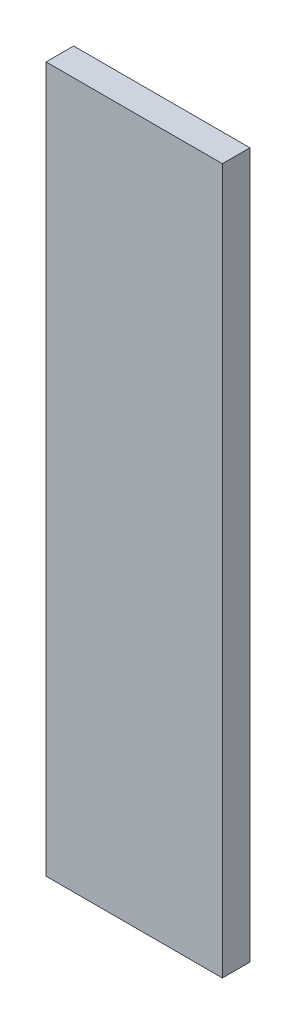
ISO-10303-21;
HEADER;
FILE_DESCRIPTION(('STEP AP214'),'2;1');
FILE_NAME('part.step','',(''),(''),'','','');
FILE_SCHEMA(('AUTOMOTIVE_DESIGN { 1 0 10303 214 1 1 1 1 }'));
ENDSEC;
DATA;
#1=APPLICATION_CONTEXT('core data for automotive mechanical design processes');
#2=APPLICATION_PROTOCOL_DEFINITION('international standard','automotive_design',2000,#1);
#3=PRODUCT_CONTEXT('',#1,'mechanical');
#4=PRODUCT('Part','Part','',(#3));
#5=PRODUCT_RELATED_PRODUCT_CATEGORY('part','',(#4));
#6=PRODUCT_DEFINITION_FORMATION('','',#4);
#7=PRODUCT_DEFINITION_CONTEXT('part definition',#1,'design');
#8=PRODUCT_DEFINITION('design','',#6,#7);
#9=PRODUCT_DEFINITION_SHAPE('','',#8);
#10=(LENGTH_UNIT() NAMED_UNIT(*) SI_UNIT(.MILLI.,.METRE.));
#11=(NAMED_UNIT(*) PLANE_ANGLE_UNIT() SI_UNIT($,.RADIAN.));
#12=(NAMED_UNIT(*) SI_UNIT($,.STERADIAN.) SOLID_ANGLE_UNIT());
#13=UNCERTAINTY_MEASURE_WITH_UNIT(LENGTH_MEASURE(1.E-05),#10,'distance_accuracy_value','');
#14=(GEOMETRIC_REPRESENTATION_CONTEXT(3) GLOBAL_UNCERTAINTY_ASSIGNED_CONTEXT((#13)) GLOBAL_UNIT_ASSIGNED_CONTEXT((#10,
#11,#12)) REPRESENTATION_CONTEXT('',''));
#15=CARTESIAN_POINT('',(0.,0.,0.));
#16=DIRECTION('',(0.,0.,1.));
#17=DIRECTION('',(1.,0.,0.));
#18=AXIS2_PLACEMENT_3D('',#15,#16,#17);
#19=CARTESIAN_POINT('',(0.,0.,-11.90625));
#20=DIRECTION('',(0.,0.,-1.));
#21=DIRECTION('',(-0.999999999999999,0.,0.));
#22=AXIS2_PLACEMENT_3D('',#19,#20,#21);
#23=PLANE('',#22);
#24=DIRECTION('',(0.,-1.,0.));
#25=VECTOR('',#24,1.);
#26=CARTESIAN_POINT('',(-38.0999999999996,409.575230505,-11.9062499999999));
#27=LINE('',#26,#25);
#28=CARTESIAN_POINT('',(-38.0999999999996,409.575230505,-11.9062499999999));
#29=VERTEX_POINT('',#28);
#30=CARTESIAN_POINT('',(-38.0999999999997,104.775230505,-11.90625));
#31=VERTEX_POINT('',#30);
#32=EDGE_CURVE('E36',#29,#31,#27,.T.);
#33=ORIENTED_EDGE('',*,*,#32,.F.);
#34=DIRECTION('',(-1.,0.,0.));
#35=VECTOR('',#34,1.);
#36=CARTESIAN_POINT('',(-38.0999999999997,409.575230505,-11.90625));
#37=LINE('',#36,#35);
#38=CARTESIAN_POINT('',(38.1000000000004,409.575230505,-11.9062499999999));
#39=VERTEX_POINT('',#38);
#40=EDGE_CURVE('E59',#39,#29,#37,.T.);
#41=ORIENTED_EDGE('',*,*,#40,.F.);
#42=DIRECTION('',(0.,1.,0.));
#43=VECTOR('',#42,1.);
#44=CARTESIAN_POINT('',(38.1000000000004,409.575230505,-11.9062499999999));
#45=LINE('',#44,#43);
#46=CARTESIAN_POINT('',(38.1000000000004,104.775230505,-11.9062500000001));
#47=VERTEX_POINT('',#46);
#48=EDGE_CURVE('E64',#47,#39,#45,.T.);
#49=ORIENTED_EDGE('',*,*,#48,.F.);
#50=DIRECTION('',(1.,0.,0.));
#51=VECTOR('',#50,1.);
#52=CARTESIAN_POINT('',(-38.0999999999997,104.775230505,-11.90625));
#53=LINE('',#52,#51);
#54=EDGE_CURVE('E79',#31,#47,#53,.T.);
#55=ORIENTED_EDGE('',*,*,#54,.F.);
#56=EDGE_LOOP('',(#33,#41,#49,#55));
#57=FACE_BOUND('',#56,.T.);
#58=ADVANCED_FACE('F28',(#57),#23,.T.);
#59=CARTESIAN_POINT('',(0.,0.,0.));
#60=DIRECTION('',(0.,0.,1.));
#61=DIRECTION('',(1.,0.,0.));
#62=AXIS2_PLACEMENT_3D('',#59,#60,#61);
#63=PLANE('',#62);
#64=DIRECTION('',(0.,-1.,0.));
#65=VECTOR('',#64,1.);
#66=CARTESIAN_POINT('',(-38.0999999999996,409.575230505,-1.11022302462516E-13));
#67=LINE('',#66,#65);
#68=CARTESIAN_POINT('',(-38.0999999999996,409.575230505,-1.11022302462516E-13));
#69=VERTEX_POINT('',#68);
#70=CARTESIAN_POINT('',(-38.0999999999997,104.775230505,-1.11022302462516E-13));
#71=VERTEX_POINT('',#70);
#72=EDGE_CURVE('E88',#69,#71,#67,.T.);
#73=ORIENTED_EDGE('',*,*,#72,.T.);
#74=DIRECTION('',(1.,0.,0.));
#75=VECTOR('',#74,1.);
#76=CARTESIAN_POINT('',(-38.0999999999997,104.775230505,-1.11022302462516E-13));
#77=LINE('',#76,#75);
#78=CARTESIAN_POINT('',(38.1000000000003,104.775230505,0.));
#79=VERTEX_POINT('',#78);
#80=EDGE_CURVE('E77',#71,#79,#77,.T.);
#81=ORIENTED_EDGE('',*,*,#80,.T.);
#82=DIRECTION('',(0.,1.,0.));
#83=VECTOR('',#82,1.);
#84=CARTESIAN_POINT('',(38.1000000000004,409.575230505,-1.11022302462516E-13));
#85=LINE('',#84,#83);
#86=CARTESIAN_POINT('',(38.1000000000004,409.575230505,-1.11022302462516E-13));
#87=VERTEX_POINT('',#86);
#88=EDGE_CURVE('E80',#79,#87,#85,.T.);
#89=ORIENTED_EDGE('',*,*,#88,.T.);
#90=DIRECTION('',(-1.,0.,0.));
#91=VECTOR('',#90,1.);
#92=CARTESIAN_POINT('',(-38.0999999999996,409.575230505,-1.11022302462516E-13));
#93=LINE('',#92,#91);
#94=EDGE_CURVE('E85',#87,#69,#93,.T.);
#95=ORIENTED_EDGE('',*,*,#94,.T.);
#96=EDGE_LOOP('',(#73,#81,#89,#95));
#97=FACE_BOUND('',#96,.T.);
#98=ADVANCED_FACE('F87',(#97),#63,.T.);
#99=CARTESIAN_POINT('',(-38.0999999999997,104.775230505,-326.086898672066));
#100=DIRECTION('',(0.,-1.,0.));
#101=DIRECTION('',(0.,0.,-1.));
#102=AXIS2_PLACEMENT_3D('',#99,#100,#101);
#103=PLANE('',#102);
#104=DIRECTION('',(0.,0.,1.));
#105=VECTOR('',#104,1.);
#106=CARTESIAN_POINT('',(-38.0999999999997,104.775230505,-326.086898672066));
#107=LINE('',#106,#105);
#108=EDGE_CURVE('E11',#31,#71,#107,.T.);
#109=ORIENTED_EDGE('',*,*,#108,.F.);
#110=ORIENTED_EDGE('',*,*,#54,.T.);
#111=DIRECTION('',(0.,0.,1.));
#112=VECTOR('',#111,1.);
#113=CARTESIAN_POINT('',(38.1000000000005,104.775230505,-326.086898672066));
#114=LINE('',#113,#112);
#115=EDGE_CURVE('E74',#47,#79,#114,.T.);
#116=ORIENTED_EDGE('',*,*,#115,.T.);
#117=ORIENTED_EDGE('',*,*,#80,.F.);
#118=EDGE_LOOP('',(#109,#110,#116,#117));
#119=FACE_BOUND('',#118,.T.);
#120=ADVANCED_FACE('F75',(#119),#103,.T.);
#121=CARTESIAN_POINT('',(38.1000000000004,409.575230505,-326.086898672066));
#122=DIRECTION('',(1.,0.,0.));
#123=DIRECTION('',(0.,0.,-1.));
#124=AXIS2_PLACEMENT_3D('',#121,#122,#123);
#125=PLANE('',#124);
#126=ORIENTED_EDGE('',*,*,#115,.F.);
#127=ORIENTED_EDGE('',*,*,#48,.T.);
#128=DIRECTION('',(0.,0.,1.));
#129=VECTOR('',#128,1.);
#130=CARTESIAN_POINT('',(38.1000000000004,409.575230505,-326.086898672066));
#131=LINE('',#130,#129);
#132=EDGE_CURVE('E69',#39,#87,#131,.T.);
#133=ORIENTED_EDGE('',*,*,#132,.T.);
#134=ORIENTED_EDGE('',*,*,#88,.F.);
#135=EDGE_LOOP('',(#126,#127,#133,#134));
#136=FACE_BOUND('',#135,.T.);
#137=ADVANCED_FACE('F81',(#136),#125,.T.);
#138=CARTESIAN_POINT('',(-38.0999999999998,409.575230505,-326.086898672066));
#139=DIRECTION('',(0.,1.,0.));
#140=DIRECTION('',(0.,0.,1.));
#141=AXIS2_PLACEMENT_3D('',#138,#139,#140);
#142=PLANE('',#141);
#143=ORIENTED_EDGE('',*,*,#132,.F.);
#144=ORIENTED_EDGE('',*,*,#40,.T.);
#145=DIRECTION('',(0.,0.,1.));
#146=VECTOR('',#145,1.);
#147=CARTESIAN_POINT('',(-38.0999999999998,409.575230505,-326.086898672066));
#148=LINE('',#147,#146);
#149=EDGE_CURVE('E95',#29,#69,#148,.T.);
#150=ORIENTED_EDGE('',*,*,#149,.T.);
#151=ORIENTED_EDGE('',*,*,#94,.F.);
#152=EDGE_LOOP('',(#143,#144,#150,#151));
#153=FACE_BOUND('',#152,.T.);
#154=ADVANCED_FACE('F101',(#153),#142,.T.);
#155=CARTESIAN_POINT('',(-38.0999999999998,409.575230505,-326.086898672066));
#156=DIRECTION('',(-1.,0.,0.));
#157=DIRECTION('',(0.,0.,1.));
#158=AXIS2_PLACEMENT_3D('',#155,#156,#157);
#159=PLANE('',#158);
#160=ORIENTED_EDGE('',*,*,#149,.F.);
#161=ORIENTED_EDGE('',*,*,#32,.T.);
#162=ORIENTED_EDGE('',*,*,#108,.T.);
#163=ORIENTED_EDGE('',*,*,#72,.F.);
#164=EDGE_LOOP('',(#160,#161,#162,#163));
#165=FACE_BOUND('',#164,.T.);
#166=ADVANCED_FACE('F102',(#165),#159,.T.);
#167=CLOSED_SHELL('',(#58,#98,#120,#137,#154,#166));
#168=MANIFOLD_SOLID_BREP('B2',#167);
#169=ADVANCED_BREP_SHAPE_REPRESENTATION('',(#18,#168),#14);
#170=SHAPE_DEFINITION_REPRESENTATION(#9,#169);
ENDSEC;
END-ISO-10303-21;
